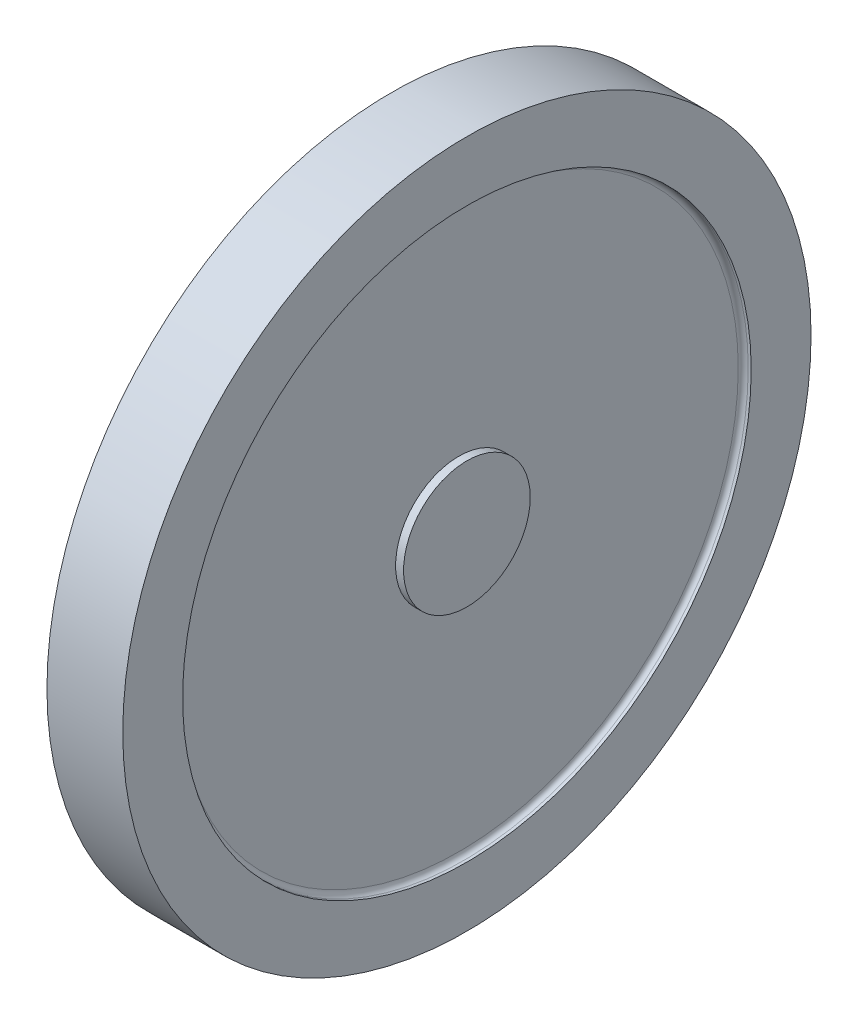
ISO-10303-21;
HEADER;
FILE_DESCRIPTION(('STEP AP214'),'2;1');
FILE_NAME('part.step','',(''),(''),'','','');
FILE_SCHEMA(('AUTOMOTIVE_DESIGN { 1 0 10303 214 1 1 1 1 }'));
ENDSEC;
DATA;
#1=APPLICATION_CONTEXT('core data for automotive mechanical design processes');
#2=APPLICATION_PROTOCOL_DEFINITION('international standard','automotive_design',2000,#1);
#3=PRODUCT_CONTEXT('',#1,'mechanical');
#4=PRODUCT('Part','Part','',(#3));
#5=PRODUCT_RELATED_PRODUCT_CATEGORY('part','',(#4));
#6=PRODUCT_DEFINITION_FORMATION('','',#4);
#7=PRODUCT_DEFINITION_CONTEXT('part definition',#1,'design');
#8=PRODUCT_DEFINITION('design','',#6,#7);
#9=PRODUCT_DEFINITION_SHAPE('','',#8);
#10=(LENGTH_UNIT() NAMED_UNIT(*) SI_UNIT(.MILLI.,.METRE.));
#11=(NAMED_UNIT(*) PLANE_ANGLE_UNIT() SI_UNIT($,.RADIAN.));
#12=(NAMED_UNIT(*) SI_UNIT($,.STERADIAN.) SOLID_ANGLE_UNIT());
#13=UNCERTAINTY_MEASURE_WITH_UNIT(LENGTH_MEASURE(1.E-05),#10,'distance_accuracy_value','');
#14=(GEOMETRIC_REPRESENTATION_CONTEXT(3) GLOBAL_UNCERTAINTY_ASSIGNED_CONTEXT((#13)) GLOBAL_UNIT_ASSIGNED_CONTEXT((#10,
#11,#12)) REPRESENTATION_CONTEXT('',''));
#15=CARTESIAN_POINT('',(0.,0.,0.));
#16=DIRECTION('',(0.,0.,1.));
#17=DIRECTION('',(1.,0.,0.));
#18=AXIS2_PLACEMENT_3D('',#15,#16,#17);
#19=CARTESIAN_POINT('',(-0.800000000000003,0.,0.));
#20=DIRECTION('',(1.,0.,0.));
#21=DIRECTION('',(0.,0.,-1.));
#22=AXIS2_PLACEMENT_3D('',#19,#20,#21);
#23=CYLINDRICAL_SURFACE('',#22,6.35);
#24=CARTESIAN_POINT('',(-0.799999999999996,0.,0.));
#25=DIRECTION('',(1.,0.,0.));
#26=DIRECTION('',(0.,0.,-1.));
#27=AXIS2_PLACEMENT_3D('',#24,#25,#26);
#28=CIRCLE('',#27,6.35);
#29=CARTESIAN_POINT('',(-0.799999999999996,0.,-6.35));
#30=VERTEX_POINT('',#29);
#31=EDGE_CURVE('E68',#30,#30,#28,.T.);
#32=ORIENTED_EDGE('',*,*,#31,.T.);
#33=EDGE_LOOP('',(#32));
#34=FACE_BOUND('',#33,.T.);
#35=CARTESIAN_POINT('',(0.,0.,0.));
#36=DIRECTION('',(1.,0.,0.));
#37=DIRECTION('',(0.,0.,-1.));
#38=AXIS2_PLACEMENT_3D('',#35,#36,#37);
#39=CIRCLE('',#38,6.35);
#40=CARTESIAN_POINT('',(0.,0.,-6.35));
#41=VERTEX_POINT('',#40);
#42=EDGE_CURVE('E53',#41,#41,#39,.T.);
#43=ORIENTED_EDGE('',*,*,#42,.F.);
#44=EDGE_LOOP('',(#43));
#45=FACE_BOUND('',#44,.T.);
#46=ADVANCED_FACE('F33',(#34,#45),#23,.T.);
#47=CARTESIAN_POINT('',(0.,6.35,0.));
#48=DIRECTION('',(1.,0.,0.));
#49=DIRECTION('',(0.,0.,-1.));
#50=AXIS2_PLACEMENT_3D('',#47,#48,#49);
#51=PLANE('',#50);
#52=ORIENTED_EDGE('',*,*,#42,.T.);
#53=EDGE_LOOP('',(#52));
#54=FACE_BOUND('',#53,.T.);
#55=ADVANCED_FACE('F87',(#54),#51,.T.);
#56=CARTESIAN_POINT('',(-6.8,28.5,0.));
#57=DIRECTION('',(-1.,0.,0.));
#58=DIRECTION('',(0.,0.,1.));
#59=AXIS2_PLACEMENT_3D('',#56,#57,#58);
#60=PLANE('',#59);
#61=CARTESIAN_POINT('',(-6.8,0.,0.));
#62=DIRECTION('',(-1.,0.,0.));
#63=DIRECTION('',(0.,0.,1.));
#64=AXIS2_PLACEMENT_3D('',#61,#62,#63);
#65=CIRCLE('',#64,28.);
#66=CARTESIAN_POINT('',(-6.8,0.,28.));
#67=VERTEX_POINT('',#66);
#68=EDGE_CURVE('E44',#67,#67,#65,.T.);
#69=ORIENTED_EDGE('',*,*,#68,.T.);
#70=EDGE_LOOP('',(#69));
#71=FACE_BOUND('',#70,.T.);
#72=ADVANCED_FACE('F92',(#71),#60,.T.);
#73=CARTESIAN_POINT('',(-0.800000000000003,0.,0.));
#74=DIRECTION('',(1.,0.,0.));
#75=DIRECTION('',(0.,0.,-1.));
#76=AXIS2_PLACEMENT_3D('',#73,#74,#75);
#77=CYLINDRICAL_SURFACE('',#76,28.5);
#78=CARTESIAN_POINT('',(-7.3,0.,0.));
#79=DIRECTION('',(-1.,0.,0.));
#80=DIRECTION('',(0.,0.,1.));
#81=AXIS2_PLACEMENT_3D('',#78,#79,#80);
#82=CIRCLE('',#81,28.5);
#83=CARTESIAN_POINT('',(-7.3,0.,28.5));
#84=VERTEX_POINT('',#83);
#85=EDGE_CURVE('E48',#84,#84,#82,.F.);
#86=ORIENTED_EDGE('',*,*,#85,.T.);
#87=EDGE_LOOP('',(#86));
#88=FACE_BOUND('',#87,.T.);
#89=CARTESIAN_POINT('',(-7.6,0.,0.));
#90=DIRECTION('',(1.,0.,0.));
#91=DIRECTION('',(0.,0.,-1.));
#92=AXIS2_PLACEMENT_3D('',#89,#90,#91);
#93=CIRCLE('',#92,28.5);
#94=CARTESIAN_POINT('',(-7.6,0.,-28.5));
#95=VERTEX_POINT('',#94);
#96=EDGE_CURVE('E56',#95,#95,#93,.T.);
#97=ORIENTED_EDGE('',*,*,#96,.F.);
#98=EDGE_LOOP('',(#97));
#99=FACE_BOUND('',#98,.T.);
#100=ADVANCED_FACE('F98',(#88,#99),#77,.F.);
#101=CARTESIAN_POINT('',(-7.6,28.5,0.));
#102=DIRECTION('',(-1.,0.,0.));
#103=DIRECTION('',(0.,0.,1.));
#104=AXIS2_PLACEMENT_3D('',#101,#102,#103);
#105=PLANE('',#104);
#106=ORIENTED_EDGE('',*,*,#96,.T.);
#107=EDGE_LOOP('',(#106));
#108=FACE_BOUND('',#107,.T.);
#109=CARTESIAN_POINT('',(-7.6,0.,0.));
#110=DIRECTION('',(1.,0.,0.));
#111=DIRECTION('',(0.,0.,-1.));
#112=AXIS2_PLACEMENT_3D('',#109,#110,#111);
#113=CIRCLE('',#112,34.5);
#114=CARTESIAN_POINT('',(-7.6,0.,-34.5));
#115=VERTEX_POINT('',#114);
#116=EDGE_CURVE('E59',#115,#115,#113,.T.);
#117=ORIENTED_EDGE('',*,*,#116,.F.);
#118=EDGE_LOOP('',(#117));
#119=FACE_BOUND('',#118,.T.);
#120=ADVANCED_FACE('F102',(#108,#119),#105,.T.);
#121=CARTESIAN_POINT('',(-0.800000000000003,0.,0.));
#122=DIRECTION('',(1.,0.,0.));
#123=DIRECTION('',(0.,0.,-1.));
#124=AXIS2_PLACEMENT_3D('',#121,#122,#123);
#125=CYLINDRICAL_SURFACE('',#124,34.5);
#126=ORIENTED_EDGE('',*,*,#116,.T.);
#127=EDGE_LOOP('',(#126));
#128=FACE_BOUND('',#127,.T.);
#129=CARTESIAN_POINT('',(0.,0.,0.));
#130=DIRECTION('',(1.,0.,0.));
#131=DIRECTION('',(0.,0.,-1.));
#132=AXIS2_PLACEMENT_3D('',#129,#130,#131);
#133=CIRCLE('',#132,34.5);
#134=CARTESIAN_POINT('',(0.,0.,-34.5));
#135=VERTEX_POINT('',#134);
#136=EDGE_CURVE('E62',#135,#135,#133,.T.);
#137=ORIENTED_EDGE('',*,*,#136,.F.);
#138=EDGE_LOOP('',(#137));
#139=FACE_BOUND('',#138,.T.);
#140=ADVANCED_FACE('F106',(#128,#139),#125,.T.);
#141=CARTESIAN_POINT('',(0.,28.5,0.));
#142=DIRECTION('',(1.,0.,0.));
#143=DIRECTION('',(0.,0.,-1.));
#144=AXIS2_PLACEMENT_3D('',#141,#142,#143);
#145=PLANE('',#144);
#146=ORIENTED_EDGE('',*,*,#136,.T.);
#147=EDGE_LOOP('',(#146));
#148=FACE_BOUND('',#147,.T.);
#149=CARTESIAN_POINT('',(0.,0.,0.));
#150=DIRECTION('',(1.,0.,0.));
#151=DIRECTION('',(0.,0.,-1.));
#152=AXIS2_PLACEMENT_3D('',#149,#150,#151);
#153=CIRCLE('',#152,28.5);
#154=CARTESIAN_POINT('',(0.,0.,-28.5));
#155=VERTEX_POINT('',#154);
#156=EDGE_CURVE('E65',#155,#155,#153,.T.);
#157=ORIENTED_EDGE('',*,*,#156,.F.);
#158=EDGE_LOOP('',(#157));
#159=FACE_BOUND('',#158,.T.);
#160=ADVANCED_FACE('F84',(#148,#159),#145,.T.);
#161=CARTESIAN_POINT('',(-0.800000000000003,0.,0.));
#162=DIRECTION('',(1.,0.,0.));
#163=DIRECTION('',(0.,0.,-1.));
#164=AXIS2_PLACEMENT_3D('',#161,#162,#163);
#165=CYLINDRICAL_SURFACE('',#164,28.5);
#166=CARTESIAN_POINT('',(-0.299999999999999,0.,0.));
#167=DIRECTION('',(1.,0.,0.));
#168=DIRECTION('',(0.,0.,-1.));
#169=AXIS2_PLACEMENT_3D('',#166,#167,#168);
#170=CIRCLE('',#169,28.5);
#171=CARTESIAN_POINT('',(-0.299999999999999,0.,-28.5));
#172=VERTEX_POINT('',#171);
#173=EDGE_CURVE('E10',#172,#172,#170,.F.);
#174=ORIENTED_EDGE('',*,*,#173,.T.);
#175=EDGE_LOOP('',(#174));
#176=FACE_BOUND('',#175,.T.);
#177=ORIENTED_EDGE('',*,*,#156,.T.);
#178=EDGE_LOOP('',(#177));
#179=FACE_BOUND('',#178,.T.);
#180=ADVANCED_FACE('F77',(#176,#179),#165,.F.);
#181=CARTESIAN_POINT('',(-0.799999999999999,28.5,0.));
#182=DIRECTION('',(1.,0.,0.));
#183=DIRECTION('',(0.,0.,-1.));
#184=AXIS2_PLACEMENT_3D('',#181,#182,#183);
#185=PLANE('',#184);
#186=CARTESIAN_POINT('',(-0.799999999999999,0.,0.));
#187=DIRECTION('',(1.,0.,0.));
#188=DIRECTION('',(0.,0.,-1.));
#189=AXIS2_PLACEMENT_3D('',#186,#187,#188);
#190=CIRCLE('',#189,28.);
#191=CARTESIAN_POINT('',(-0.799999999999999,0.,-28.));
#192=VERTEX_POINT('',#191);
#193=EDGE_CURVE('E40',#192,#192,#190,.T.);
#194=ORIENTED_EDGE('',*,*,#193,.T.);
#195=EDGE_LOOP('',(#194));
#196=FACE_BOUND('',#195,.T.);
#197=ORIENTED_EDGE('',*,*,#31,.F.);
#198=EDGE_LOOP('',(#197));
#199=FACE_BOUND('',#198,.T.);
#200=ADVANCED_FACE('F74',(#196,#199),#185,.T.);
#201=CARTESIAN_POINT('',(-7.3,0.,0.));
#202=DIRECTION('',(-1.,0.,0.));
#203=DIRECTION('',(0.,0.,1.));
#204=AXIS2_PLACEMENT_3D('',#201,#202,#203);
#205=TOROIDAL_SURFACE('',#204,28.,0.5);
#206=ORIENTED_EDGE('',*,*,#68,.F.);
#207=EDGE_LOOP('',(#206));
#208=FACE_BOUND('',#207,.T.);
#209=ORIENTED_EDGE('',*,*,#85,.F.);
#210=EDGE_LOOP('',(#209));
#211=FACE_BOUND('',#210,.T.);
#212=ADVANCED_FACE('F76',(#208,#211),#205,.F.);
#213=CARTESIAN_POINT('',(-0.299999999999999,0.,0.));
#214=DIRECTION('',(1.,0.,0.));
#215=DIRECTION('',(0.,0.,-1.));
#216=AXIS2_PLACEMENT_3D('',#213,#214,#215);
#217=TOROIDAL_SURFACE('',#216,28.,0.5);
#218=ORIENTED_EDGE('',*,*,#173,.F.);
#219=EDGE_LOOP('',(#218));
#220=FACE_BOUND('',#219,.T.);
#221=ORIENTED_EDGE('',*,*,#193,.F.);
#222=EDGE_LOOP('',(#221));
#223=FACE_BOUND('',#222,.T.);
#224=ADVANCED_FACE('F35',(#220,#223),#217,.F.);
#225=CLOSED_SHELL('',(#46,#55,#72,#100,#120,#140,#160,#180,#200,#212,#224));
#226=MANIFOLD_SOLID_BREP('B2',#225);
#227=ADVANCED_BREP_SHAPE_REPRESENTATION('',(#18,#226),#14);
#228=SHAPE_DEFINITION_REPRESENTATION(#9,#227);
ENDSEC;
END-ISO-10303-21;
